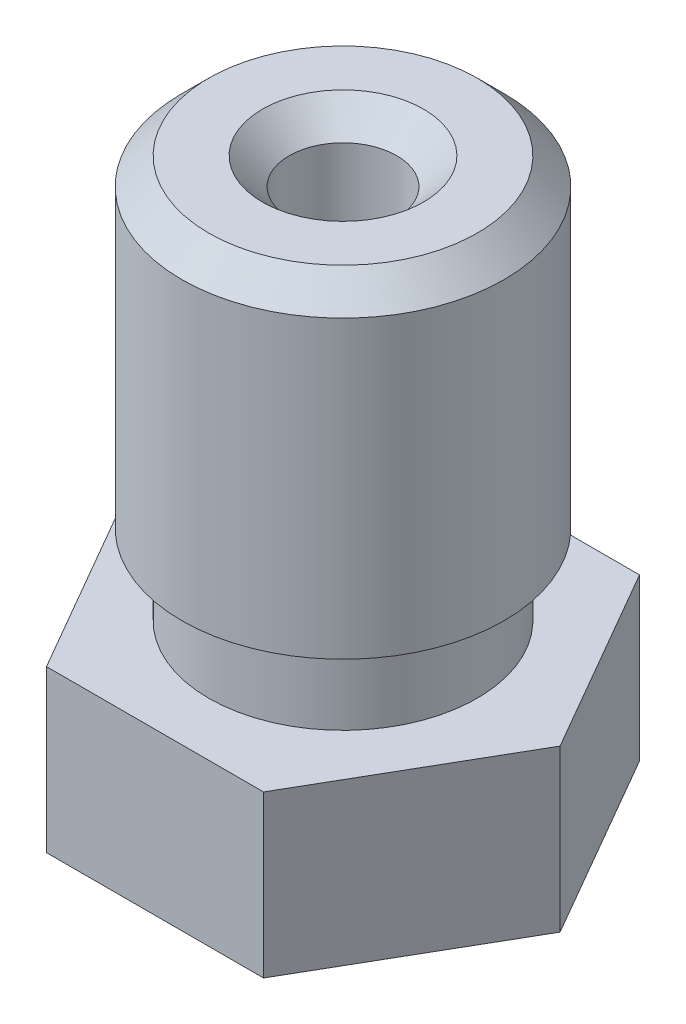
ISO-10303-21;
HEADER;
FILE_DESCRIPTION(('STEP AP214'),'2;1');
FILE_NAME('part.step','',(''),(''),'','','');
FILE_SCHEMA(('AUTOMOTIVE_DESIGN { 1 0 10303 214 1 1 1 1 }'));
ENDSEC;
DATA;
#1=APPLICATION_CONTEXT('core data for automotive mechanical design processes');
#2=APPLICATION_PROTOCOL_DEFINITION('international standard','automotive_design',2000,#1);
#3=PRODUCT_CONTEXT('',#1,'mechanical');
#4=PRODUCT('Part','Part','',(#3));
#5=PRODUCT_RELATED_PRODUCT_CATEGORY('part','',(#4));
#6=PRODUCT_DEFINITION_FORMATION('','',#4);
#7=PRODUCT_DEFINITION_CONTEXT('part definition',#1,'design');
#8=PRODUCT_DEFINITION('design','',#6,#7);
#9=PRODUCT_DEFINITION_SHAPE('','',#8);
#10=(LENGTH_UNIT() NAMED_UNIT(*) SI_UNIT(.MILLI.,.METRE.));
#11=(NAMED_UNIT(*) PLANE_ANGLE_UNIT() SI_UNIT($,.RADIAN.));
#12=(NAMED_UNIT(*) SI_UNIT($,.STERADIAN.) SOLID_ANGLE_UNIT());
#13=UNCERTAINTY_MEASURE_WITH_UNIT(LENGTH_MEASURE(1.E-05),#10,'distance_accuracy_value','');
#14=(GEOMETRIC_REPRESENTATION_CONTEXT(3) GLOBAL_UNCERTAINTY_ASSIGNED_CONTEXT((#13)) GLOBAL_UNIT_ASSIGNED_CONTEXT((#10,
#11,#12)) REPRESENTATION_CONTEXT('',''));
#15=CARTESIAN_POINT('',(0.,0.,0.));
#16=DIRECTION('',(0.,0.,1.));
#17=DIRECTION('',(1.,0.,0.));
#18=AXIS2_PLACEMENT_3D('',#15,#16,#17);
#19=CARTESIAN_POINT('',(-4.089949307,3.,-3.5));
#20=DIRECTION('',(0.,1.,0.));
#21=DIRECTION('',(0.,0.,1.));
#22=AXIS2_PLACEMENT_3D('',#19,#20,#21);
#23=PLANE('',#22);
#24=CARTESIAN_POINT('',(0.,3.,0.));
#25=DIRECTION('',(0.,1.,0.));
#26=DIRECTION('',(0.,0.,1.));
#27=AXIS2_PLACEMENT_3D('',#24,#25,#26);
#28=CIRCLE('',#27,2.5);
#29=CARTESIAN_POINT('',(0.,3.,2.5));
#30=VERTEX_POINT('',#29);
#31=EDGE_CURVE('E20',#30,#30,#28,.F.);
#32=ORIENTED_EDGE('',*,*,#31,.T.);
#33=EDGE_LOOP('',(#32));
#34=FACE_BOUND('',#33,.T.);
#35=DIRECTION('',(-0.499999999969623,0.,0.866025403801977));
#36=VECTOR('',#35,1.);
#37=CARTESIAN_POINT('',(-3.031088913,3.,-1.75));
#38=LINE('',#37,#36);
#39=CARTESIAN_POINT('',(-2.02072594179785,3.,-3.5));
#40=VERTEX_POINT('',#39);
#41=CARTESIAN_POINT('',(-4.04145188302546,3.,-9.87682591963024E-10));
#42=VERTEX_POINT('',#41);
#43=EDGE_CURVE('E354',#40,#42,#38,.T.);
#44=ORIENTED_EDGE('',*,*,#43,.T.);
#45=DIRECTION('',(0.499999999969623,0.,0.866025403801977));
#46=VECTOR('',#45,1.);
#47=CARTESIAN_POINT('',(-3.031088913,3.,1.75));
#48=LINE('',#47,#46);
#49=CARTESIAN_POINT('',(-2.02072594179785,3.,3.5));
#50=VERTEX_POINT('',#49);
#51=EDGE_CURVE('E351',#42,#50,#48,.T.);
#52=ORIENTED_EDGE('',*,*,#51,.T.);
#53=DIRECTION('',(1.,0.,0.));
#54=VECTOR('',#53,1.);
#55=CARTESIAN_POINT('',(0.,3.,3.5));
#56=LINE('',#55,#54);
#57=CARTESIAN_POINT('',(2.0207259415957,3.,3.5));
#58=VERTEX_POINT('',#57);
#59=EDGE_CURVE('E80',#50,#58,#56,.T.);
#60=ORIENTED_EDGE('',*,*,#59,.T.);
#61=DIRECTION('',(0.499999999969623,0.,-0.866025403801977));
#62=VECTOR('',#61,1.);
#63=CARTESIAN_POINT('',(3.031088913,3.,1.75));
#64=LINE('',#63,#62);
#65=CARTESIAN_POINT('',(4.04145188302546,3.,9.87682591963024E-10));
#66=VERTEX_POINT('',#65);
#67=EDGE_CURVE('E63',#58,#66,#64,.T.);
#68=ORIENTED_EDGE('',*,*,#67,.T.);
#69=DIRECTION('',(-0.499999999969623,0.,-0.866025403801977));
#70=VECTOR('',#69,1.);
#71=CARTESIAN_POINT('',(3.031088913,3.,-1.75));
#72=LINE('',#71,#70);
#73=CARTESIAN_POINT('',(2.02072594179785,3.,-3.5));
#74=VERTEX_POINT('',#73);
#75=EDGE_CURVE('E77',#66,#74,#72,.T.);
#76=ORIENTED_EDGE('',*,*,#75,.T.);
#77=DIRECTION('',(-1.,0.,0.));
#78=VECTOR('',#77,1.);
#79=CARTESIAN_POINT('',(0.,3.,-3.5));
#80=LINE('',#79,#78);
#81=EDGE_CURVE('E96',#74,#40,#80,.T.);
#82=ORIENTED_EDGE('',*,*,#81,.T.);
#83=EDGE_LOOP('',(#44,#52,#60,#68,#76,#82));
#84=FACE_BOUND('',#83,.T.);
#85=ADVANCED_FACE('F16',(#34,#84),#23,.T.);
#86=CARTESIAN_POINT('',(4.041451884,0.,0.));
#87=DIRECTION('',(-0.866025403801977,0.,-0.499999999969623));
#88=DIRECTION('',(-0.499999999969623,0.,0.866025403801977));
#89=AXIS2_PLACEMENT_3D('',#86,#87,#88);
#90=PLANE('',#89);
#91=DIRECTION('',(0.,1.,0.));
#92=VECTOR('',#91,1.);
#93=CARTESIAN_POINT('',(4.041451884,1.5,0.));
#94=LINE('',#93,#92);
#95=CARTESIAN_POINT('',(4.041451884,0.,0.));
#96=VERTEX_POINT('',#95);
#97=EDGE_CURVE('E81',#96,#66,#94,.T.);
#98=ORIENTED_EDGE('',*,*,#97,.T.);
#99=ORIENTED_EDGE('',*,*,#67,.F.);
#100=DIRECTION('',(0.,-1.,0.));
#101=VECTOR('',#100,1.);
#102=CARTESIAN_POINT('',(2.020725942,1.5,3.5));
#103=LINE('',#102,#101);
#104=CARTESIAN_POINT('',(2.020725942,0.,3.5));
#105=VERTEX_POINT('',#104);
#106=EDGE_CURVE('E97',#58,#105,#103,.T.);
#107=ORIENTED_EDGE('',*,*,#106,.T.);
#108=DIRECTION('',(-0.499999999969623,0.,0.866025403801977));
#109=VECTOR('',#108,1.);
#110=CARTESIAN_POINT('',(4.041451884,0.,0.));
#111=LINE('',#110,#109);
#112=EDGE_CURVE('E54',#105,#96,#111,.F.);
#113=ORIENTED_EDGE('',*,*,#112,.T.);
#114=EDGE_LOOP('',(#98,#99,#107,#113));
#115=FACE_BOUND('',#114,.T.);
#116=ADVANCED_FACE('F89',(#115),#90,.F.);
#117=CARTESIAN_POINT('',(2.020725942,0.,-3.5));
#118=DIRECTION('',(-0.866025403801977,0.,0.499999999969623));
#119=DIRECTION('',(0.499999999969623,0.,0.866025403801977));
#120=AXIS2_PLACEMENT_3D('',#117,#118,#119);
#121=PLANE('',#120);
#122=DIRECTION('',(0.,1.,0.));
#123=VECTOR('',#122,1.);
#124=CARTESIAN_POINT('',(2.020725942,1.5,-3.5));
#125=LINE('',#124,#123);
#126=CARTESIAN_POINT('',(2.020725942,0.,-3.5));
#127=VERTEX_POINT('',#126);
#128=EDGE_CURVE('E87',#127,#74,#125,.T.);
#129=ORIENTED_EDGE('',*,*,#128,.T.);
#130=ORIENTED_EDGE('',*,*,#75,.F.);
#131=ORIENTED_EDGE('',*,*,#97,.F.);
#132=DIRECTION('',(0.499999999969623,0.,0.866025403801977));
#133=VECTOR('',#132,1.);
#134=CARTESIAN_POINT('',(2.020725942,0.,-3.5));
#135=LINE('',#134,#133);
#136=EDGE_CURVE('E130',#96,#127,#135,.F.);
#137=ORIENTED_EDGE('',*,*,#136,.T.);
#138=EDGE_LOOP('',(#129,#130,#131,#137));
#139=FACE_BOUND('',#138,.T.);
#140=ADVANCED_FACE('F85',(#139),#121,.F.);
#141=CARTESIAN_POINT('',(-2.020725942,0.,-3.5));
#142=DIRECTION('',(0.,0.,1.));
#143=DIRECTION('',(1.,0.,0.));
#144=AXIS2_PLACEMENT_3D('',#141,#142,#143);
#145=PLANE('',#144);
#146=DIRECTION('',(0.,1.,0.));
#147=VECTOR('',#146,1.);
#148=CARTESIAN_POINT('',(-2.020725942,1.5,-3.5));
#149=LINE('',#148,#147);
#150=CARTESIAN_POINT('',(-2.020725942,0.,-3.5));
#151=VERTEX_POINT('',#150);
#152=EDGE_CURVE('E356',#151,#40,#149,.T.);
#153=ORIENTED_EDGE('',*,*,#152,.T.);
#154=ORIENTED_EDGE('',*,*,#81,.F.);
#155=ORIENTED_EDGE('',*,*,#128,.F.);
#156=DIRECTION('',(-1.,0.,0.));
#157=VECTOR('',#156,1.);
#158=CARTESIAN_POINT('',(0.,0.,-3.5));
#159=LINE('',#158,#157);
#160=EDGE_CURVE('E93',#127,#151,#159,.T.);
#161=ORIENTED_EDGE('',*,*,#160,.T.);
#162=EDGE_LOOP('',(#153,#154,#155,#161));
#163=FACE_BOUND('',#162,.T.);
#164=ADVANCED_FACE('F214',(#163),#145,.F.);
#165=CARTESIAN_POINT('',(-4.041451884,0.,0.));
#166=DIRECTION('',(0.866025403801977,0.,0.499999999969623));
#167=DIRECTION('',(0.499999999969623,0.,-0.866025403801977));
#168=AXIS2_PLACEMENT_3D('',#165,#166,#167);
#169=PLANE('',#168);
#170=DIRECTION('',(0.,1.,0.));
#171=VECTOR('',#170,1.);
#172=CARTESIAN_POINT('',(-4.041451884,1.5,0.));
#173=LINE('',#172,#171);
#174=CARTESIAN_POINT('',(-4.041451884,0.,0.));
#175=VERTEX_POINT('',#174);
#176=EDGE_CURVE('E353',#175,#42,#173,.T.);
#177=ORIENTED_EDGE('',*,*,#176,.T.);
#178=ORIENTED_EDGE('',*,*,#43,.F.);
#179=ORIENTED_EDGE('',*,*,#152,.F.);
#180=DIRECTION('',(0.499999999969623,0.,-0.866025403801977));
#181=VECTOR('',#180,1.);
#182=CARTESIAN_POINT('',(-4.041451884,0.,0.));
#183=LINE('',#182,#181);
#184=EDGE_CURVE('E127',#151,#175,#183,.F.);
#185=ORIENTED_EDGE('',*,*,#184,.T.);
#186=EDGE_LOOP('',(#177,#178,#179,#185));
#187=FACE_BOUND('',#186,.T.);
#188=ADVANCED_FACE('F210',(#187),#169,.F.);
#189=CARTESIAN_POINT('',(-2.020725942,0.,3.5));
#190=DIRECTION('',(0.866025403801977,0.,-0.499999999969623));
#191=DIRECTION('',(-0.499999999969623,0.,-0.866025403801977));
#192=AXIS2_PLACEMENT_3D('',#189,#190,#191);
#193=PLANE('',#192);
#194=DIRECTION('',(0.,1.,0.));
#195=VECTOR('',#194,1.);
#196=CARTESIAN_POINT('',(-2.020725942,1.5,3.5));
#197=LINE('',#196,#195);
#198=CARTESIAN_POINT('',(-2.020725942,0.,3.5));
#199=VERTEX_POINT('',#198);
#200=EDGE_CURVE('E35',#199,#50,#197,.T.);
#201=ORIENTED_EDGE('',*,*,#200,.T.);
#202=ORIENTED_EDGE('',*,*,#51,.F.);
#203=ORIENTED_EDGE('',*,*,#176,.F.);
#204=DIRECTION('',(-0.499999999969623,0.,-0.866025403801977));
#205=VECTOR('',#204,1.);
#206=CARTESIAN_POINT('',(-2.020725942,0.,3.5));
#207=LINE('',#206,#205);
#208=EDGE_CURVE('E124',#175,#199,#207,.F.);
#209=ORIENTED_EDGE('',*,*,#208,.T.);
#210=EDGE_LOOP('',(#201,#202,#203,#209));
#211=FACE_BOUND('',#210,.T.);
#212=ADVANCED_FACE('F149',(#211),#193,.F.);
#213=CARTESIAN_POINT('',(2.020725942,0.,3.5));
#214=DIRECTION('',(0.,0.,-1.));
#215=DIRECTION('',(-1.,0.,0.));
#216=AXIS2_PLACEMENT_3D('',#213,#214,#215);
#217=PLANE('',#216);
#218=ORIENTED_EDGE('',*,*,#106,.F.);
#219=ORIENTED_EDGE('',*,*,#59,.F.);
#220=ORIENTED_EDGE('',*,*,#200,.F.);
#221=DIRECTION('',(1.,0.,0.));
#222=VECTOR('',#221,1.);
#223=CARTESIAN_POINT('',(0.,0.,3.5));
#224=LINE('',#223,#222);
#225=EDGE_CURVE('E123',#199,#105,#224,.T.);
#226=ORIENTED_EDGE('',*,*,#225,.T.);
#227=EDGE_LOOP('',(#218,#219,#220,#226));
#228=FACE_BOUND('',#227,.T.);
#229=ADVANCED_FACE('F138',(#228),#217,.F.);
#230=CARTESIAN_POINT('',(0.,3.,0.));
#231=DIRECTION('',(0.,1.,0.));
#232=DIRECTION('',(0.,0.,1.));
#233=AXIS2_PLACEMENT_3D('',#230,#231,#232);
#234=CYLINDRICAL_SURFACE('',#233,2.5);
#235=CARTESIAN_POINT('',(0.,4.5,0.));
#236=DIRECTION('',(0.,1.,0.));
#237=DIRECTION('',(0.,0.,1.));
#238=AXIS2_PLACEMENT_3D('',#235,#236,#237);
#239=CIRCLE('',#238,2.5);
#240=CARTESIAN_POINT('',(0.,4.5,2.5));
#241=VERTEX_POINT('',#240);
#242=EDGE_CURVE('E120',#241,#241,#239,.F.);
#243=ORIENTED_EDGE('',*,*,#242,.T.);
#244=EDGE_LOOP('',(#243));
#245=FACE_BOUND('',#244,.T.);
#246=ORIENTED_EDGE('',*,*,#31,.F.);
#247=EDGE_LOOP('',(#246));
#248=FACE_BOUND('',#247,.T.);
#249=ADVANCED_FACE('F135',(#245,#248),#234,.T.);
#250=CARTESIAN_POINT('',(-4.089949307,0.,-3.5));
#251=DIRECTION('',(0.,1.,0.));
#252=DIRECTION('',(0.,0.,1.));
#253=AXIS2_PLACEMENT_3D('',#250,#251,#252);
#254=PLANE('',#253);
#255=CARTESIAN_POINT('',(0.,0.,0.));
#256=DIRECTION('',(0.,1.,0.));
#257=DIRECTION('',(0.,0.,1.));
#258=AXIS2_PLACEMENT_3D('',#255,#256,#257);
#259=CIRCLE('',#258,2.5);
#260=CARTESIAN_POINT('',(0.,0.,2.5));
#261=VERTEX_POINT('',#260);
#262=EDGE_CURVE('E117',#261,#261,#259,.T.);
#263=ORIENTED_EDGE('',*,*,#262,.T.);
#264=EDGE_LOOP('',(#263));
#265=FACE_BOUND('',#264,.T.);
#266=ORIENTED_EDGE('',*,*,#208,.F.);
#267=ORIENTED_EDGE('',*,*,#184,.F.);
#268=ORIENTED_EDGE('',*,*,#160,.F.);
#269=ORIENTED_EDGE('',*,*,#136,.F.);
#270=ORIENTED_EDGE('',*,*,#112,.F.);
#271=ORIENTED_EDGE('',*,*,#225,.F.);
#272=EDGE_LOOP('',(#266,#267,#268,#269,#270,#271));
#273=FACE_BOUND('',#272,.T.);
#274=ADVANCED_FACE('F137',(#265,#273),#254,.F.);
#275=CARTESIAN_POINT('',(-3.036,4.5,-3.036));
#276=DIRECTION('',(0.,1.,0.));
#277=DIRECTION('',(0.,0.,1.));
#278=AXIS2_PLACEMENT_3D('',#275,#276,#277);
#279=PLANE('',#278);
#280=ORIENTED_EDGE('',*,*,#242,.F.);
#281=EDGE_LOOP('',(#280));
#282=FACE_BOUND('',#281,.T.);
#283=CARTESIAN_POINT('',(0.,4.5,0.));
#284=DIRECTION('',(0.,1.,0.));
#285=DIRECTION('',(0.,0.,1.));
#286=AXIS2_PLACEMENT_3D('',#283,#284,#285);
#287=CIRCLE('',#286,3.);
#288=CARTESIAN_POINT('',(0.,4.5,3.));
#289=VERTEX_POINT('',#288);
#290=EDGE_CURVE('E114',#289,#289,#287,.F.);
#291=ORIENTED_EDGE('',*,*,#290,.T.);
#292=EDGE_LOOP('',(#291));
#293=FACE_BOUND('',#292,.T.);
#294=ADVANCED_FACE('F146',(#282,#293),#279,.F.);
#295=CARTESIAN_POINT('',(0.,-2.,0.));
#296=DIRECTION('',(0.,1.,0.));
#297=DIRECTION('',(0.,0.,1.));
#298=AXIS2_PLACEMENT_3D('',#295,#296,#297);
#299=CONICAL_SURFACE('',#298,0.5,0.785398163397448);
#300=ORIENTED_EDGE('',*,*,#262,.F.);
#301=EDGE_LOOP('',(#300));
#302=FACE_BOUND('',#301,.T.);
#303=CARTESIAN_POINT('',(0.,-2.,0.));
#304=DIRECTION('',(0.,1.,0.));
#305=DIRECTION('',(0.,0.,1.));
#306=AXIS2_PLACEMENT_3D('',#303,#304,#305);
#307=CIRCLE('',#306,0.499999999999998);
#308=CARTESIAN_POINT('',(0.,-2.,0.499999999999998));
#309=VERTEX_POINT('',#308);
#310=EDGE_CURVE('E111',#309,#309,#307,.T.);
#311=ORIENTED_EDGE('',*,*,#310,.T.);
#312=EDGE_LOOP('',(#311));
#313=FACE_BOUND('',#312,.T.);
#314=ADVANCED_FACE('F189',(#302,#313),#299,.T.);
#315=CARTESIAN_POINT('',(0.,4.5,0.));
#316=DIRECTION('',(0.,1.,0.));
#317=DIRECTION('',(0.,0.,1.));
#318=AXIS2_PLACEMENT_3D('',#315,#316,#317);
#319=CYLINDRICAL_SURFACE('',#318,3.);
#320=ORIENTED_EDGE('',*,*,#290,.F.);
#321=EDGE_LOOP('',(#320));
#322=FACE_BOUND('',#321,.T.);
#323=CARTESIAN_POINT('',(0.,10.,0.));
#324=DIRECTION('',(0.,-1.,0.));
#325=DIRECTION('',(0.,0.,-1.));
#326=AXIS2_PLACEMENT_3D('',#323,#324,#325);
#327=CIRCLE('',#326,3.);
#328=CARTESIAN_POINT('',(0.,10.,-3.));
#329=VERTEX_POINT('',#328);
#330=EDGE_CURVE('E110',#329,#329,#327,.T.);
#331=ORIENTED_EDGE('',*,*,#330,.T.);
#332=EDGE_LOOP('',(#331));
#333=FACE_BOUND('',#332,.T.);
#334=ADVANCED_FACE('F187',(#322,#333),#319,.T.);
#335=CARTESIAN_POINT('',(-0.506,-2.,-0.506));
#336=DIRECTION('',(0.,1.,0.));
#337=DIRECTION('',(0.,0.,1.));
#338=AXIS2_PLACEMENT_3D('',#335,#336,#337);
#339=PLANE('',#338);
#340=CARTESIAN_POINT('',(0.,-2.,0.));
#341=DIRECTION('',(0.,1.,0.));
#342=DIRECTION('',(0.,0.,1.));
#343=AXIS2_PLACEMENT_3D('',#340,#341,#342);
#344=CIRCLE('',#343,0.2);
#345=CARTESIAN_POINT('',(0.,-2.,0.2));
#346=VERTEX_POINT('',#345);
#347=EDGE_CURVE('E107',#346,#346,#344,.F.);
#348=ORIENTED_EDGE('',*,*,#347,.F.);
#349=EDGE_LOOP('',(#348));
#350=FACE_BOUND('',#349,.T.);
#351=ORIENTED_EDGE('',*,*,#310,.F.);
#352=EDGE_LOOP('',(#351));
#353=FACE_BOUND('',#352,.T.);
#354=ADVANCED_FACE('F185',(#350,#353),#339,.F.);
#355=CARTESIAN_POINT('',(0.,10.5,0.));
#356=DIRECTION('',(0.,-1.,0.));
#357=DIRECTION('',(0.,0.,-1.));
#358=AXIS2_PLACEMENT_3D('',#355,#356,#357);
#359=CONICAL_SURFACE('',#358,2.5,0.785398163397448);
#360=CARTESIAN_POINT('',(0.,10.5,0.));
#361=DIRECTION('',(0.,-1.,0.));
#362=DIRECTION('',(0.,0.,-1.));
#363=AXIS2_PLACEMENT_3D('',#360,#361,#362);
#364=CIRCLE('',#363,2.50000000000005);
#365=CARTESIAN_POINT('',(0.,10.5,-2.50000000000005));
#366=VERTEX_POINT('',#365);
#367=EDGE_CURVE('E104',#366,#366,#364,.T.);
#368=ORIENTED_EDGE('',*,*,#367,.T.);
#369=EDGE_LOOP('',(#368));
#370=FACE_BOUND('',#369,.T.);
#371=ORIENTED_EDGE('',*,*,#330,.F.);
#372=EDGE_LOOP('',(#371));
#373=FACE_BOUND('',#372,.T.);
#374=ADVANCED_FACE('F181',(#370,#373),#359,.T.);
#375=CARTESIAN_POINT('',(0.,-2.,0.));
#376=DIRECTION('',(0.,1.,0.));
#377=DIRECTION('',(0.,0.,1.));
#378=AXIS2_PLACEMENT_3D('',#375,#376,#377);
#379=CYLINDRICAL_SURFACE('',#378,0.2);
#380=CARTESIAN_POINT('',(0.,-1.20000000000009,0.));
#381=DIRECTION('',(0.,1.,0.));
#382=DIRECTION('',(0.,4.49943901581484E-13,1.));
#383=AXIS2_PLACEMENT_3D('',#380,#381,#382);
#384=CIRCLE('',#383,0.2);
#385=CARTESIAN_POINT('',(0.,-1.2,0.2));
#386=VERTEX_POINT('',#385);
#387=EDGE_CURVE('E103',#386,#386,#384,.F.);
#388=ORIENTED_EDGE('',*,*,#387,.F.);
#389=EDGE_LOOP('',(#388));
#390=FACE_BOUND('',#389,.T.);
#391=ORIENTED_EDGE('',*,*,#347,.T.);
#392=EDGE_LOOP('',(#391));
#393=FACE_BOUND('',#392,.T.);
#394=ADVANCED_FACE('F178',(#390,#393),#379,.F.);
#395=CARTESIAN_POINT('',(-2.53,10.5,2.53));
#396=DIRECTION('',(0.,-1.,0.));
#397=DIRECTION('',(0.,0.,-1.));
#398=AXIS2_PLACEMENT_3D('',#395,#396,#397);
#399=PLANE('',#398);
#400=CARTESIAN_POINT('',(0.,10.5,0.));
#401=DIRECTION('',(0.,1.,0.));
#402=DIRECTION('',(-1.,0.,0.));
#403=AXIS2_PLACEMENT_3D('',#400,#401,#402);
#404=CIRCLE('',#403,1.49999999999995);
#405=CARTESIAN_POINT('',(-1.49999999999995,10.5,0.));
#406=VERTEX_POINT('',#405);
#407=EDGE_CURVE('E99',#406,#406,#404,.T.);
#408=ORIENTED_EDGE('',*,*,#407,.F.);
#409=EDGE_LOOP('',(#408));
#410=FACE_BOUND('',#409,.T.);
#411=ORIENTED_EDGE('',*,*,#367,.F.);
#412=EDGE_LOOP('',(#411));
#413=FACE_BOUND('',#412,.T.);
#414=ADVANCED_FACE('F18',(#410,#413),#399,.F.);
#415=CARTESIAN_POINT('',(0.,-1.2,0.));
#416=DIRECTION('',(0.,1.,0.));
#417=DIRECTION('',(0.,0.,1.));
#418=AXIS2_PLACEMENT_3D('',#415,#416,#417);
#419=CONICAL_SURFACE('',#418,0.2,0.832981266674432);
#420=ORIENTED_EDGE('',*,*,#387,.T.);
#421=EDGE_LOOP('',(#420));
#422=FACE_BOUND('',#421,.T.);
#423=CARTESIAN_POINT('',(0.,-0.7,0.));
#424=DIRECTION('',(0.,1.,0.));
#425=DIRECTION('',(0.,0.,1.));
#426=AXIS2_PLACEMENT_3D('',#423,#424,#425);
#427=CIRCLE('',#426,0.75);
#428=CARTESIAN_POINT('',(0.,-0.7,0.75));
#429=VERTEX_POINT('',#428);
#430=EDGE_CURVE('E102',#429,#429,#427,.F.);
#431=ORIENTED_EDGE('',*,*,#430,.F.);
#432=EDGE_LOOP('',(#431));
#433=FACE_BOUND('',#432,.T.);
#434=ADVANCED_FACE('F173',(#422,#433),#419,.F.);
#435=CARTESIAN_POINT('',(0.,10.,0.));
#436=DIRECTION('',(0.,1.,0.));
#437=DIRECTION('',(-1.,0.,0.));
#438=AXIS2_PLACEMENT_3D('',#435,#436,#437);
#439=CONICAL_SURFACE('',#438,1.,0.785398163397448);
#440=ORIENTED_EDGE('',*,*,#407,.T.);
#441=EDGE_LOOP('',(#440));
#442=FACE_BOUND('',#441,.T.);
#443=CARTESIAN_POINT('',(0.,10.,0.));
#444=DIRECTION('',(0.,-1.,0.));
#445=DIRECTION('',(0.,0.,-1.));
#446=AXIS2_PLACEMENT_3D('',#443,#444,#445);
#447=CIRCLE('',#446,1.);
#448=CARTESIAN_POINT('',(0.,10.,-1.));
#449=VERTEX_POINT('',#448);
#450=EDGE_CURVE('E348',#449,#449,#447,.F.);
#451=ORIENTED_EDGE('',*,*,#450,.F.);
#452=EDGE_LOOP('',(#451));
#453=FACE_BOUND('',#452,.T.);
#454=ADVANCED_FACE('F169',(#442,#453),#439,.F.);
#455=CARTESIAN_POINT('',(0.,-0.7,0.));
#456=DIRECTION('',(0.,1.,0.));
#457=DIRECTION('',(0.,0.,1.));
#458=AXIS2_PLACEMENT_3D('',#455,#456,#457);
#459=CYLINDRICAL_SURFACE('',#458,0.75);
#460=ORIENTED_EDGE('',*,*,#430,.T.);
#461=EDGE_LOOP('',(#460));
#462=FACE_BOUND('',#461,.T.);
#463=CARTESIAN_POINT('',(0.,-0.227272727000072,0.));
#464=DIRECTION('',(0.,1.,0.));
#465=DIRECTION('',(0.,0.,1.));
#466=AXIS2_PLACEMENT_3D('',#463,#464,#465);
#467=CIRCLE('',#466,0.75);
#468=CARTESIAN_POINT('',(0.,-0.227272727,0.75));
#469=VERTEX_POINT('',#468);
#470=EDGE_CURVE('E26',#469,#469,#467,.F.);
#471=ORIENTED_EDGE('',*,*,#470,.F.);
#472=EDGE_LOOP('',(#471));
#473=FACE_BOUND('',#472,.T.);
#474=ADVANCED_FACE('F161',(#462,#473),#459,.F.);
#475=CARTESIAN_POINT('',(0.,10.,0.));
#476=DIRECTION('',(0.,-1.,0.));
#477=DIRECTION('',(1.,0.,0.));
#478=AXIS2_PLACEMENT_3D('',#475,#476,#477);
#479=CYLINDRICAL_SURFACE('',#478,1.);
#480=CARTESIAN_POINT('',(0.,0.,0.));
#481=DIRECTION('',(0.,1.,0.));
#482=DIRECTION('',(0.,0.,1.));
#483=AXIS2_PLACEMENT_3D('',#480,#481,#482);
#484=CIRCLE('',#483,1.);
#485=CARTESIAN_POINT('',(0.,0.,1.));
#486=VERTEX_POINT('',#485);
#487=EDGE_CURVE('E11',#486,#486,#484,.T.);
#488=ORIENTED_EDGE('',*,*,#487,.F.);
#489=EDGE_LOOP('',(#488));
#490=FACE_BOUND('',#489,.T.);
#491=ORIENTED_EDGE('',*,*,#450,.T.);
#492=EDGE_LOOP('',(#491));
#493=FACE_BOUND('',#492,.T.);
#494=ADVANCED_FACE('F155',(#490,#493),#479,.F.);
#495=CARTESIAN_POINT('',(0.,-0.227272727,0.));
#496=DIRECTION('',(0.,1.,0.));
#497=DIRECTION('',(0.,0.,1.));
#498=AXIS2_PLACEMENT_3D('',#495,#496,#497);
#499=CONICAL_SURFACE('',#498,0.75,0.832981267271717);
#500=ORIENTED_EDGE('',*,*,#470,.T.);
#501=EDGE_LOOP('',(#500));
#502=FACE_BOUND('',#501,.T.);
#503=ORIENTED_EDGE('',*,*,#487,.T.);
#504=EDGE_LOOP('',(#503));
#505=FACE_BOUND('',#504,.T.);
#506=ADVANCED_FACE('F153',(#502,#505),#499,.F.);
#507=CLOSED_SHELL('',(#85,#116,#140,#164,#188,#212,#229,#249,#274,#294,#314,#334,#354,#374,#394,
#414,#434,#454,#474,#494,#506));
#508=MANIFOLD_SOLID_BREP('B1',#507);
#509=ADVANCED_BREP_SHAPE_REPRESENTATION('',(#18,#508),#14);
#510=SHAPE_DEFINITION_REPRESENTATION(#9,#509);
ENDSEC;
END-ISO-10303-21;
